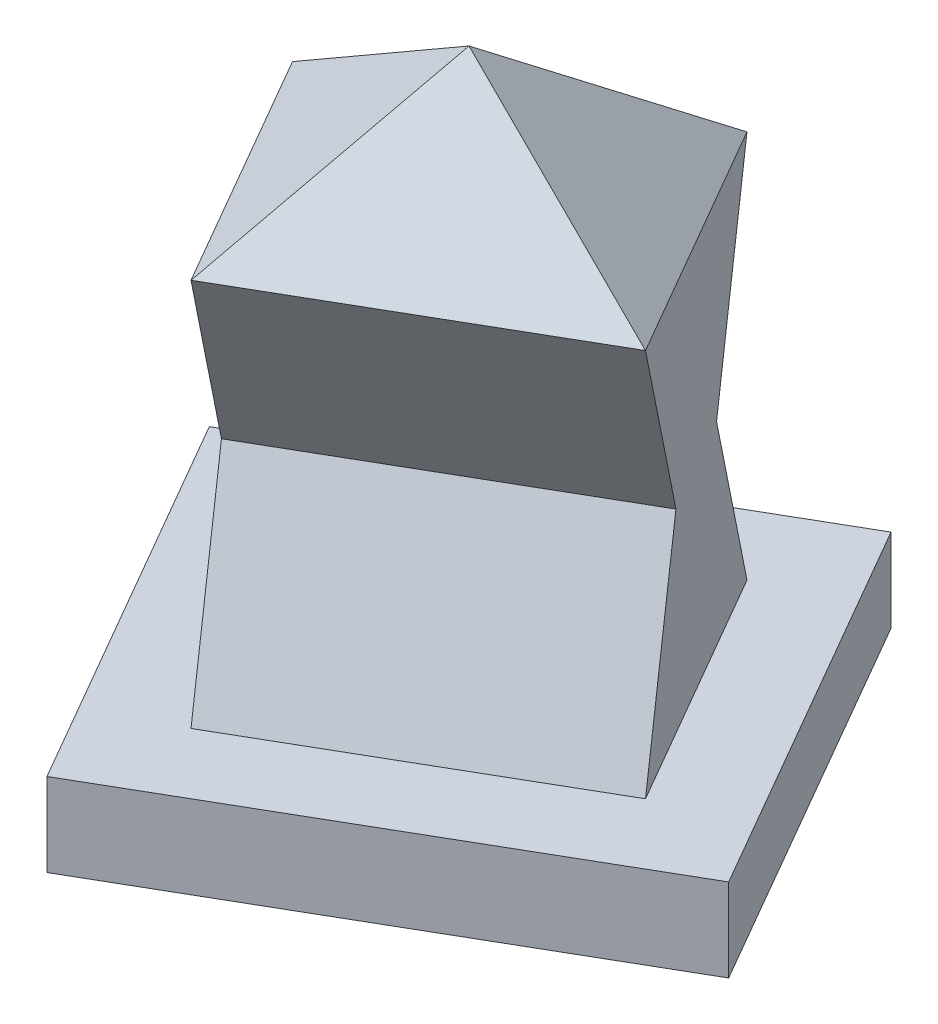
ISO-10303-21;
HEADER;
FILE_DESCRIPTION(('STEP AP214'),'2;1');
FILE_NAME('part.step','',(''),(''),'','','');
FILE_SCHEMA(('AUTOMOTIVE_DESIGN { 1 0 10303 214 1 1 1 1 }'));
ENDSEC;
DATA;
#1=APPLICATION_CONTEXT('core data for automotive mechanical design processes');
#2=APPLICATION_PROTOCOL_DEFINITION('international standard','automotive_design',2000,#1);
#3=PRODUCT_CONTEXT('',#1,'mechanical');
#4=PRODUCT('Part','Part','',(#3));
#5=PRODUCT_RELATED_PRODUCT_CATEGORY('part','',(#4));
#6=PRODUCT_DEFINITION_FORMATION('','',#4);
#7=PRODUCT_DEFINITION_CONTEXT('part definition',#1,'design');
#8=PRODUCT_DEFINITION('design','',#6,#7);
#9=PRODUCT_DEFINITION_SHAPE('','',#8);
#10=(LENGTH_UNIT() NAMED_UNIT(*) SI_UNIT(.MILLI.,.METRE.));
#11=(NAMED_UNIT(*) PLANE_ANGLE_UNIT() SI_UNIT($,.RADIAN.));
#12=(NAMED_UNIT(*) SI_UNIT($,.STERADIAN.) SOLID_ANGLE_UNIT());
#13=UNCERTAINTY_MEASURE_WITH_UNIT(LENGTH_MEASURE(1.E-05),#10,'distance_accuracy_value','');
#14=(GEOMETRIC_REPRESENTATION_CONTEXT(3) GLOBAL_UNCERTAINTY_ASSIGNED_CONTEXT((#13)) GLOBAL_UNIT_ASSIGNED_CONTEXT((#10,
#11,#12)) REPRESENTATION_CONTEXT('',''));
#15=CARTESIAN_POINT('',(0.,0.,0.));
#16=DIRECTION('',(0.,0.,1.));
#17=DIRECTION('',(1.,0.,0.));
#18=AXIS2_PLACEMENT_3D('',#15,#16,#17);
#19=CARTESIAN_POINT('',(-58.9711431702997,15.,-12.1410161513779));
#20=DIRECTION('',(0.,-1.,0.));
#21=DIRECTION('',(0.,0.,-1.));
#22=AXIS2_PLACEMENT_3D('',#19,#20,#21);
#23=PLANE('',#22);
#24=DIRECTION('',(0.499999999999995,0.,0.866025403784442));
#25=VECTOR('',#24,1.);
#26=CARTESIAN_POINT('',(-18.9711431703001,15.,57.1410161513774));
#27=LINE('',#26,#25);
#28=CARTESIAN_POINT('',(-58.9711431702997,15.,-12.1410161513779));
#29=VERTEX_POINT('',#28);
#30=CARTESIAN_POINT('',(-18.9711431703001,15.,57.1410161513774));
#31=VERTEX_POINT('',#30);
#32=EDGE_CURVE('E124',#29,#31,#27,.T.);
#33=ORIENTED_EDGE('',*,*,#32,.T.);
#34=DIRECTION('',(0.866025403784441,0.,-0.499999999999995));
#35=VECTOR('',#34,1.);
#36=CARTESIAN_POINT('',(58.9711431702997,15.,12.1410161513779));
#37=LINE('',#36,#35);
#38=CARTESIAN_POINT('',(58.9711431702997,15.,12.1410161513779));
#39=VERTEX_POINT('',#38);
#40=EDGE_CURVE('E117',#31,#39,#37,.T.);
#41=ORIENTED_EDGE('',*,*,#40,.T.);
#42=DIRECTION('',(-0.499999999999995,0.,-0.866025403784442));
#43=VECTOR('',#42,1.);
#44=CARTESIAN_POINT('',(18.9711431703001,15.,-57.1410161513774));
#45=LINE('',#44,#43);
#46=CARTESIAN_POINT('',(18.9711431703001,15.,-57.1410161513774));
#47=VERTEX_POINT('',#46);
#48=EDGE_CURVE('E121',#39,#47,#45,.T.);
#49=ORIENTED_EDGE('',*,*,#48,.T.);
#50=DIRECTION('',(-0.866025403784442,0.,0.499999999999995));
#51=VECTOR('',#50,1.);
#52=CARTESIAN_POINT('',(-58.9711431702997,15.,-12.1410161513779));
#53=LINE('',#52,#51);
#54=EDGE_CURVE('E53',#47,#29,#53,.T.);
#55=ORIENTED_EDGE('',*,*,#54,.T.);
#56=EDGE_LOOP('',(#33,#41,#49,#55));
#57=FACE_BOUND('',#56,.T.);
#58=DIRECTION('',(0.5,0.,0.866025403784438));
#59=VECTOR('',#58,1.);
#60=CARTESIAN_POINT('',(-13.4807621135331,15.,36.6506350946107));
#61=LINE('',#60,#59);
#62=CARTESIAN_POINT('',(-38.4807621135329,15.,-6.65063509461084));
#63=VERTEX_POINT('',#62);
#64=CARTESIAN_POINT('',(-13.4807621135331,15.,36.6506350946107));
#65=VERTEX_POINT('',#64);
#66=EDGE_CURVE('E205',#63,#65,#61,.T.);
#67=ORIENTED_EDGE('',*,*,#66,.F.);
#68=DIRECTION('',(-0.866025403784438,0.,0.5));
#69=VECTOR('',#68,1.);
#70=CARTESIAN_POINT('',(-38.4807621135329,15.,-6.65063509461085));
#71=LINE('',#70,#69);
#72=CARTESIAN_POINT('',(13.4807621135334,15.,-36.6506350946109));
#73=VERTEX_POINT('',#72);
#74=EDGE_CURVE('E164',#73,#63,#71,.T.);
#75=ORIENTED_EDGE('',*,*,#74,.F.);
#76=DIRECTION('',(-0.5,0.,-0.866025403784438));
#77=VECTOR('',#76,1.);
#78=CARTESIAN_POINT('',(13.4807621135331,15.,-36.6506350946106));
#79=LINE('',#78,#77);
#80=CARTESIAN_POINT('',(38.4807621135332,15.,6.65063509461065));
#81=VERTEX_POINT('',#80);
#82=EDGE_CURVE('E210',#81,#73,#79,.T.);
#83=ORIENTED_EDGE('',*,*,#82,.F.);
#84=DIRECTION('',(0.866025403784438,0.,-0.5));
#85=VECTOR('',#84,1.);
#86=CARTESIAN_POINT('',(38.4807621135329,15.,6.65063509461087));
#87=LINE('',#86,#85);
#88=EDGE_CURVE('E208',#65,#81,#87,.T.);
#89=ORIENTED_EDGE('',*,*,#88,.F.);
#90=EDGE_LOOP('',(#67,#75,#83,#89));
#91=FACE_BOUND('',#90,.T.);
#92=ADVANCED_FACE('F34',(#57,#91),#23,.F.);
#93=CARTESIAN_POINT('',(-18.9711431703001,15.,57.1410161513774));
#94=DIRECTION('',(0.866025403784441,0.,-0.499999999999995));
#95=DIRECTION('',(-0.499999999999995,0.,-0.866025403784442));
#96=AXIS2_PLACEMENT_3D('',#93,#94,#95);
#97=PLANE('',#96);
#98=DIRECTION('',(0.499999999999995,0.,0.866025403784442));
#99=VECTOR('',#98,1.);
#100=CARTESIAN_POINT('',(-18.9711431703001,0.,57.1410161513774));
#101=LINE('',#100,#99);
#102=CARTESIAN_POINT('',(-58.9711431702997,0.,-12.1410161513779));
#103=VERTEX_POINT('',#102);
#104=CARTESIAN_POINT('',(-18.9711431703001,0.,57.1410161513774));
#105=VERTEX_POINT('',#104);
#106=EDGE_CURVE('E167',#103,#105,#101,.T.);
#107=ORIENTED_EDGE('',*,*,#106,.T.);
#108=DIRECTION('',(0.,-1.,0.));
#109=VECTOR('',#108,1.);
#110=CARTESIAN_POINT('',(-18.9711431703001,15.,57.1410161513774));
#111=LINE('',#110,#109);
#112=EDGE_CURVE('E12',#31,#105,#111,.T.);
#113=ORIENTED_EDGE('',*,*,#112,.F.);
#114=ORIENTED_EDGE('',*,*,#32,.F.);
#115=DIRECTION('',(0.,-1.,0.));
#116=VECTOR('',#115,1.);
#117=CARTESIAN_POINT('',(-58.9711431702997,15.,-12.1410161513779));
#118=LINE('',#117,#116);
#119=EDGE_CURVE('E138',#29,#103,#118,.T.);
#120=ORIENTED_EDGE('',*,*,#119,.T.);
#121=EDGE_LOOP('',(#107,#113,#114,#120));
#122=FACE_BOUND('',#121,.T.);
#123=ADVANCED_FACE('F36',(#122),#97,.F.);
#124=CARTESIAN_POINT('',(58.9711431702997,15.,12.1410161513779));
#125=DIRECTION('',(-0.499999999999995,0.,-0.866025403784441));
#126=DIRECTION('',(-0.866025403784442,0.,0.499999999999995));
#127=AXIS2_PLACEMENT_3D('',#124,#125,#126);
#128=PLANE('',#127);
#129=DIRECTION('',(0.866025403784441,0.,-0.499999999999995));
#130=VECTOR('',#129,1.);
#131=CARTESIAN_POINT('',(58.9711431702997,0.,12.1410161513779));
#132=LINE('',#131,#130);
#133=CARTESIAN_POINT('',(58.9711431702997,0.,12.1410161513779));
#134=VERTEX_POINT('',#133);
#135=EDGE_CURVE('E130',#105,#134,#132,.T.);
#136=ORIENTED_EDGE('',*,*,#135,.T.);
#137=DIRECTION('',(0.,-1.,0.));
#138=VECTOR('',#137,1.);
#139=CARTESIAN_POINT('',(58.9711431702997,15.,12.1410161513779));
#140=LINE('',#139,#138);
#141=EDGE_CURVE('E44',#39,#134,#140,.T.);
#142=ORIENTED_EDGE('',*,*,#141,.F.);
#143=ORIENTED_EDGE('',*,*,#40,.F.);
#144=ORIENTED_EDGE('',*,*,#112,.T.);
#145=EDGE_LOOP('',(#136,#142,#143,#144));
#146=FACE_BOUND('',#145,.T.);
#147=ADVANCED_FACE('F129',(#146),#128,.F.);
#148=CARTESIAN_POINT('',(18.9711431703001,15.,-57.1410161513774));
#149=DIRECTION('',(-0.866025403784442,0.,0.499999999999995));
#150=DIRECTION('',(0.499999999999995,0.,0.866025403784442));
#151=AXIS2_PLACEMENT_3D('',#148,#149,#150);
#152=PLANE('',#151);
#153=DIRECTION('',(-0.499999999999995,0.,-0.866025403784442));
#154=VECTOR('',#153,1.);
#155=CARTESIAN_POINT('',(18.9711431703001,0.,-57.1410161513774));
#156=LINE('',#155,#154);
#157=CARTESIAN_POINT('',(18.9711431703001,0.,-57.1410161513774));
#158=VERTEX_POINT('',#157);
#159=EDGE_CURVE('E217',#134,#158,#156,.T.);
#160=ORIENTED_EDGE('',*,*,#159,.T.);
#161=DIRECTION('',(0.,-1.,0.));
#162=VECTOR('',#161,1.);
#163=CARTESIAN_POINT('',(18.9711431703001,15.,-57.1410161513774));
#164=LINE('',#163,#162);
#165=EDGE_CURVE('E133',#47,#158,#164,.T.);
#166=ORIENTED_EDGE('',*,*,#165,.F.);
#167=ORIENTED_EDGE('',*,*,#48,.F.);
#168=ORIENTED_EDGE('',*,*,#141,.T.);
#169=EDGE_LOOP('',(#160,#166,#167,#168));
#170=FACE_BOUND('',#169,.T.);
#171=ADVANCED_FACE('F135',(#170),#152,.F.);
#172=CARTESIAN_POINT('',(-58.9711431702997,15.,-12.1410161513779));
#173=DIRECTION('',(0.499999999999995,0.,0.866025403784442));
#174=DIRECTION('',(0.866025403784442,0.,-0.499999999999995));
#175=AXIS2_PLACEMENT_3D('',#172,#173,#174);
#176=PLANE('',#175);
#177=DIRECTION('',(-0.866025403784442,0.,0.499999999999995));
#178=VECTOR('',#177,1.);
#179=CARTESIAN_POINT('',(-58.9711431702997,0.,-12.1410161513779));
#180=LINE('',#179,#178);
#181=EDGE_CURVE('E219',#158,#103,#180,.T.);
#182=ORIENTED_EDGE('',*,*,#181,.T.);
#183=ORIENTED_EDGE('',*,*,#119,.F.);
#184=ORIENTED_EDGE('',*,*,#54,.F.);
#185=ORIENTED_EDGE('',*,*,#165,.T.);
#186=EDGE_LOOP('',(#182,#183,#184,#185));
#187=FACE_BOUND('',#186,.T.);
#188=ADVANCED_FACE('F222',(#187),#176,.F.);
#189=CARTESIAN_POINT('',(-58.9711431702997,0.,-12.1410161513779));
#190=DIRECTION('',(0.,-1.,0.));
#191=DIRECTION('',(0.,0.,-1.));
#192=AXIS2_PLACEMENT_3D('',#189,#190,#191);
#193=PLANE('',#192);
#194=ORIENTED_EDGE('',*,*,#106,.F.);
#195=ORIENTED_EDGE('',*,*,#181,.F.);
#196=ORIENTED_EDGE('',*,*,#159,.F.);
#197=ORIENTED_EDGE('',*,*,#135,.F.);
#198=EDGE_LOOP('',(#194,#195,#196,#197));
#199=FACE_BOUND('',#198,.T.);
#200=ADVANCED_FACE('F226',(#199),#193,.T.);
#201=CARTESIAN_POINT('',(-13.4807621135331,85.,36.6506350946107));
#202=DIRECTION('',(0.866025403784439,0.,-0.5));
#203=DIRECTION('',(-0.5,0.,-0.866025403784439));
#204=AXIS2_PLACEMENT_3D('',#201,#202,#203);
#205=PLANE('',#204);
#206=DIRECTION('',(0.196959649289581,-0.91914503001806,0.341144119610502));
#207=VECTOR('',#206,1.);
#208=CARTESIAN_POINT('',(-13.4807621135331,15.,36.6506350946107));
#209=LINE('',#208,#207);
#210=CARTESIAN_POINT('',(-20.980762113533,50.,23.6602540378443));
#211=VERTEX_POINT('',#210);
#212=EDGE_CURVE('E86',#211,#65,#209,.T.);
#213=ORIENTED_EDGE('',*,*,#212,.F.);
#214=DIRECTION('',(-0.196959649289581,-0.91914503001806,-0.341144119610502));
#215=VECTOR('',#214,1.);
#216=CARTESIAN_POINT('',(-20.980762113533,50.,23.6602540378443));
#217=LINE('',#216,#215);
#218=CARTESIAN_POINT('',(-13.4807621135331,85.,36.6506350946107));
#219=VERTEX_POINT('',#218);
#220=EDGE_CURVE('E158',#219,#211,#217,.T.);
#221=ORIENTED_EDGE('',*,*,#220,.F.);
#222=DIRECTION('',(0.5,0.,0.866025403784439));
#223=VECTOR('',#222,1.);
#224=CARTESIAN_POINT('',(-38.4807621135328,85.,-6.65063509461083));
#225=LINE('',#224,#223);
#226=CARTESIAN_POINT('',(-38.4807621135329,85.,-6.65063509461085));
#227=VERTEX_POINT('',#226);
#228=EDGE_CURVE('E161',#227,#219,#225,.T.);
#229=ORIENTED_EDGE('',*,*,#228,.F.);
#230=DIRECTION('',(-0.196959649289581,0.91914503001806,-0.341144119610502));
#231=VECTOR('',#230,1.);
#232=CARTESIAN_POINT('',(-38.4807621135329,85.,-6.65063509461084));
#233=LINE('',#232,#231);
#234=CARTESIAN_POINT('',(-30.980762113533,50.,6.33974596215553));
#235=VERTEX_POINT('',#234);
#236=EDGE_CURVE('E145',#235,#227,#233,.T.);
#237=ORIENTED_EDGE('',*,*,#236,.F.);
#238=DIRECTION('',(0.196959649289581,0.91914503001806,0.341144119610502));
#239=VECTOR('',#238,1.);
#240=CARTESIAN_POINT('',(-30.980762113533,50.,6.33974596215553));
#241=LINE('',#240,#239);
#242=EDGE_CURVE('E149',#63,#235,#241,.T.);
#243=ORIENTED_EDGE('',*,*,#242,.F.);
#244=ORIENTED_EDGE('',*,*,#66,.T.);
#245=EDGE_LOOP('',(#213,#221,#229,#237,#243,#244));
#246=FACE_BOUND('',#245,.T.);
#247=ADVANCED_FACE('F228',(#246),#205,.F.);
#248=CARTESIAN_POINT('',(13.4807621135331,85.,-36.6506350946106));
#249=DIRECTION('',(-0.866025403784439,0.,0.5));
#250=DIRECTION('',(0.5,0.,0.866025403784439));
#251=AXIS2_PLACEMENT_3D('',#248,#249,#250);
#252=PLANE('',#251);
#253=DIRECTION('',(-0.499999999999993,0.,-0.866025403784443));
#254=VECTOR('',#253,1.);
#255=CARTESIAN_POINT('',(38.4807621135328,85.,6.65063509461087));
#256=LINE('',#255,#254);
#257=CARTESIAN_POINT('',(38.480762113533,85.,6.65063509461077));
#258=VERTEX_POINT('',#257);
#259=CARTESIAN_POINT('',(13.4807621135334,85.,-36.6506350946108));
#260=VERTEX_POINT('',#259);
#261=EDGE_CURVE('E168',#258,#260,#256,.T.);
#262=ORIENTED_EDGE('',*,*,#261,.F.);
#263=DIRECTION('',(-0.196959649289581,-0.91914503001806,-0.341144119610502));
#264=VECTOR('',#263,1.);
#265=CARTESIAN_POINT('',(30.9807621135333,50.,-6.33974596215571));
#266=LINE('',#265,#264);
#267=CARTESIAN_POINT('',(30.9807621135333,50.,-6.33974596215571));
#268=VERTEX_POINT('',#267);
#269=EDGE_CURVE('E154',#258,#268,#266,.T.);
#270=ORIENTED_EDGE('',*,*,#269,.T.);
#271=DIRECTION('',(0.196959649289581,-0.91914503001806,0.341144119610502));
#272=VECTOR('',#271,1.);
#273=CARTESIAN_POINT('',(38.4807621135332,15.,6.65063509461065));
#274=LINE('',#273,#272);
#275=EDGE_CURVE('E157',#268,#81,#274,.T.);
#276=ORIENTED_EDGE('',*,*,#275,.T.);
#277=ORIENTED_EDGE('',*,*,#82,.T.);
#278=DIRECTION('',(0.196959649289581,0.91914503001806,0.341144119610502));
#279=VECTOR('',#278,1.);
#280=CARTESIAN_POINT('',(20.9807621135333,50.,-23.6602540378445));
#281=LINE('',#280,#279);
#282=CARTESIAN_POINT('',(20.9807621135333,50.,-23.6602540378445));
#283=VERTEX_POINT('',#282);
#284=EDGE_CURVE('E148',#73,#283,#281,.T.);
#285=ORIENTED_EDGE('',*,*,#284,.T.);
#286=DIRECTION('',(-0.196959649289581,0.91914503001806,-0.341144119610502));
#287=VECTOR('',#286,1.);
#288=CARTESIAN_POINT('',(13.4807621135334,85.,-36.6506350946109));
#289=LINE('',#288,#287);
#290=EDGE_CURVE('E150',#283,#260,#289,.T.);
#291=ORIENTED_EDGE('',*,*,#290,.T.);
#292=EDGE_LOOP('',(#262,#270,#276,#277,#285,#291));
#293=FACE_BOUND('',#292,.T.);
#294=ADVANCED_FACE('F186',(#293),#252,.F.);
#295=CARTESIAN_POINT('',(20.9807621135333,50.,-23.6602540378445));
#296=DIRECTION('',(0.45957251500903,-0.393919298579162,0.79600294575785));
#297=DIRECTION('',(0.866025403784438,0.,-0.5));
#298=AXIS2_PLACEMENT_3D('',#295,#296,#297);
#299=PLANE('',#298);
#300=ORIENTED_EDGE('',*,*,#242,.T.);
#301=DIRECTION('',(-0.866025403784438,0.,0.5));
#302=VECTOR('',#301,1.);
#303=CARTESIAN_POINT('',(20.9807621135333,50.,-23.6602540378445));
#304=LINE('',#303,#302);
#305=EDGE_CURVE('E153',#283,#235,#304,.T.);
#306=ORIENTED_EDGE('',*,*,#305,.F.);
#307=ORIENTED_EDGE('',*,*,#284,.F.);
#308=ORIENTED_EDGE('',*,*,#74,.T.);
#309=EDGE_LOOP('',(#300,#306,#307,#308));
#310=FACE_BOUND('',#309,.T.);
#311=ADVANCED_FACE('F271',(#310),#299,.F.);
#312=CARTESIAN_POINT('',(13.4807621135334,85.,-36.6506350946109));
#313=DIRECTION('',(0.45957251500903,0.393919298579163,0.79600294575785));
#314=DIRECTION('',(0.866025403784438,0.,-0.5));
#315=AXIS2_PLACEMENT_3D('',#312,#313,#314);
#316=PLANE('',#315);
#317=ORIENTED_EDGE('',*,*,#236,.T.);
#318=DIRECTION('',(-0.866025403784439,0.,0.5));
#319=VECTOR('',#318,1.);
#320=CARTESIAN_POINT('',(13.4807621135334,85.,-36.6506350946108));
#321=LINE('',#320,#319);
#322=EDGE_CURVE('E165',#260,#227,#321,.T.);
#323=ORIENTED_EDGE('',*,*,#322,.F.);
#324=ORIENTED_EDGE('',*,*,#290,.F.);
#325=ORIENTED_EDGE('',*,*,#305,.T.);
#326=EDGE_LOOP('',(#317,#323,#324,#325));
#327=FACE_BOUND('',#326,.T.);
#328=ADVANCED_FACE('F276',(#327),#316,.F.);
#329=CARTESIAN_POINT('',(30.9807621135333,50.,-6.33974596215571));
#330=DIRECTION('',(-0.45957251500903,0.393919298579162,-0.79600294575785));
#331=DIRECTION('',(-0.866025403784439,0.,0.5));
#332=AXIS2_PLACEMENT_3D('',#329,#330,#331);
#333=PLANE('',#332);
#334=ORIENTED_EDGE('',*,*,#220,.T.);
#335=DIRECTION('',(-0.866025403784438,0.,0.5));
#336=VECTOR('',#335,1.);
#337=CARTESIAN_POINT('',(30.9807621135333,50.,-6.33974596215571));
#338=LINE('',#337,#336);
#339=EDGE_CURVE('E182',#268,#211,#338,.T.);
#340=ORIENTED_EDGE('',*,*,#339,.F.);
#341=ORIENTED_EDGE('',*,*,#269,.F.);
#342=DIRECTION('',(0.866025403784438,0.,-0.5));
#343=VECTOR('',#342,1.);
#344=CARTESIAN_POINT('',(-13.4807621135331,85.,36.6506350946107));
#345=LINE('',#344,#343);
#346=EDGE_CURVE('E38',#219,#258,#345,.T.);
#347=ORIENTED_EDGE('',*,*,#346,.F.);
#348=EDGE_LOOP('',(#334,#340,#341,#347));
#349=FACE_BOUND('',#348,.T.);
#350=ADVANCED_FACE('F181',(#349),#333,.F.);
#351=CARTESIAN_POINT('',(38.4807621135332,15.,6.65063509461065));
#352=DIRECTION('',(-0.45957251500903,-0.393919298579162,-0.79600294575785));
#353=DIRECTION('',(-0.866025403784439,0.,0.5));
#354=AXIS2_PLACEMENT_3D('',#351,#352,#353);
#355=PLANE('',#354);
#356=ORIENTED_EDGE('',*,*,#212,.T.);
#357=ORIENTED_EDGE('',*,*,#88,.T.);
#358=ORIENTED_EDGE('',*,*,#275,.F.);
#359=ORIENTED_EDGE('',*,*,#339,.T.);
#360=EDGE_LOOP('',(#356,#357,#358,#359));
#361=FACE_BOUND('',#360,.T.);
#362=ADVANCED_FACE('F286',(#361),#355,.F.);
#363=CARTESIAN_POINT('',(0.,110.,0.));
#364=DIRECTION('',(-0.353553390593276,-0.707106781186544,-0.612372435695797));
#365=DIRECTION('',(0.,0.654653670707981,-0.755928946018452));
#366=AXIS2_PLACEMENT_3D('',#363,#364,#365);
#367=PLANE('',#366);
#368=DIRECTION('',(-0.829897458736816,0.539163866017195,-0.143431285163201));
#369=VECTOR('',#368,1.);
#370=CARTESIAN_POINT('',(38.4807621135329,85.,6.65063509461087));
#371=LINE('',#370,#369);
#372=CARTESIAN_POINT('',(0.,110.,0.));
#373=VERTEX_POINT('',#372);
#374=EDGE_CURVE('E179',#258,#373,#371,.T.);
#375=ORIENTED_EDGE('',*,*,#374,.T.);
#376=DIRECTION('',(0.290733592719625,0.539163866017195,-0.790427924383831));
#377=VECTOR('',#376,1.);
#378=CARTESIAN_POINT('',(-13.4807621135331,85.,36.6506350946107));
#379=LINE('',#378,#377);
#380=EDGE_CURVE('E160',#219,#373,#379,.T.);
#381=ORIENTED_EDGE('',*,*,#380,.F.);
#382=ORIENTED_EDGE('',*,*,#346,.T.);
#383=EDGE_LOOP('',(#375,#381,#382));
#384=FACE_BOUND('',#383,.T.);
#385=ADVANCED_FACE('F178',(#384),#367,.F.);
#386=CARTESIAN_POINT('',(0.,110.,0.));
#387=DIRECTION('',(0.554415953215932,-0.768221279597374,-0.320092199832241));
#388=DIRECTION('',(0.810884854079381,0.585205735980656,0.));
#389=AXIS2_PLACEMENT_3D('',#386,#387,#388);
#390=PLANE('',#389);
#391=ORIENTED_EDGE('',*,*,#380,.T.);
#392=DIRECTION('',(0.829897458736816,0.539163866017195,0.143431285163201));
#393=VECTOR('',#392,1.);
#394=CARTESIAN_POINT('',(-38.4807621135329,85.,-6.65063509461085));
#395=LINE('',#394,#393);
#396=EDGE_CURVE('E194',#227,#373,#395,.T.);
#397=ORIENTED_EDGE('',*,*,#396,.F.);
#398=ORIENTED_EDGE('',*,*,#228,.T.);
#399=EDGE_LOOP('',(#391,#397,#398));
#400=FACE_BOUND('',#399,.T.);
#401=ADVANCED_FACE('F326',(#400),#390,.F.);
#402=CARTESIAN_POINT('',(0.,110.,0.));
#403=DIRECTION('',(-0.554415953215933,-0.768221279597376,0.320092199832236));
#404=DIRECTION('',(0.810884854079381,-0.585205735980655,0.));
#405=AXIS2_PLACEMENT_3D('',#402,#403,#404);
#406=PLANE('',#405);
#407=DIRECTION('',(-0.290733592719631,0.539163866017192,0.79042792438383));
#408=VECTOR('',#407,1.);
#409=CARTESIAN_POINT('',(13.4807621135334,85.,-36.6506350946109));
#410=LINE('',#409,#408);
#411=EDGE_CURVE('E190',#260,#373,#410,.T.);
#412=ORIENTED_EDGE('',*,*,#411,.T.);
#413=ORIENTED_EDGE('',*,*,#374,.F.);
#414=ORIENTED_EDGE('',*,*,#261,.T.);
#415=EDGE_LOOP('',(#412,#413,#414));
#416=FACE_BOUND('',#415,.T.);
#417=ADVANCED_FACE('F189',(#416),#406,.F.);
#418=CARTESIAN_POINT('',(0.,110.,0.));
#419=DIRECTION('',(0.353553390593276,-0.707106781186544,0.612372435695798));
#420=DIRECTION('',(0.,-0.654653670707981,-0.755928946018451));
#421=AXIS2_PLACEMENT_3D('',#418,#419,#420);
#422=PLANE('',#421);
#423=ORIENTED_EDGE('',*,*,#396,.T.);
#424=ORIENTED_EDGE('',*,*,#411,.F.);
#425=ORIENTED_EDGE('',*,*,#322,.T.);
#426=EDGE_LOOP('',(#423,#424,#425));
#427=FACE_BOUND('',#426,.T.);
#428=ADVANCED_FACE('F292',(#427),#422,.F.);
#429=CLOSED_SHELL('',(#92,#123,#147,#171,#188,#200,#247,#294,#311,#328,#350,#362,#385,#401,#417,#428));
#430=MANIFOLD_SOLID_BREP('B2',#429);
#431=ADVANCED_BREP_SHAPE_REPRESENTATION('',(#18,#430),#14);
#432=SHAPE_DEFINITION_REPRESENTATION(#9,#431);
ENDSEC;
END-ISO-10303-21;
